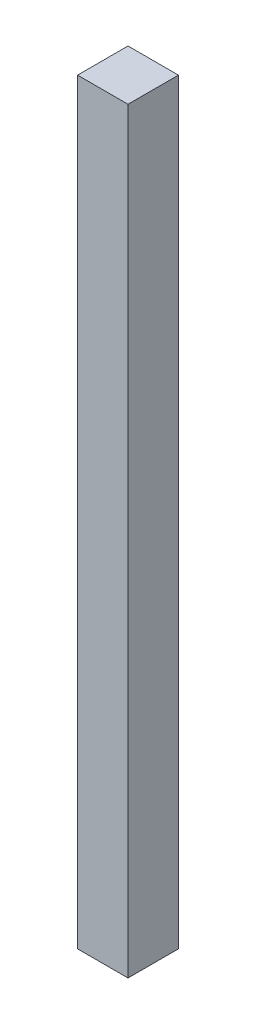
ISO-10303-21;
HEADER;
FILE_DESCRIPTION(('STEP AP214'),'2;1');
FILE_NAME('part.step','',(''),(''),'','','');
FILE_SCHEMA(('AUTOMOTIVE_DESIGN { 1 0 10303 214 1 1 1 1 }'));
ENDSEC;
DATA;
#1=APPLICATION_CONTEXT('core data for automotive mechanical design processes');
#2=APPLICATION_PROTOCOL_DEFINITION('international standard','automotive_design',2000,#1);
#3=PRODUCT_CONTEXT('',#1,'mechanical');
#4=PRODUCT('Part','Part','',(#3));
#5=PRODUCT_RELATED_PRODUCT_CATEGORY('part','',(#4));
#6=PRODUCT_DEFINITION_FORMATION('','',#4);
#7=PRODUCT_DEFINITION_CONTEXT('part definition',#1,'design');
#8=PRODUCT_DEFINITION('design','',#6,#7);
#9=PRODUCT_DEFINITION_SHAPE('','',#8);
#10=(LENGTH_UNIT() NAMED_UNIT(*) SI_UNIT(.MILLI.,.METRE.));
#11=(NAMED_UNIT(*) PLANE_ANGLE_UNIT() SI_UNIT($,.RADIAN.));
#12=(NAMED_UNIT(*) SI_UNIT($,.STERADIAN.) SOLID_ANGLE_UNIT());
#13=UNCERTAINTY_MEASURE_WITH_UNIT(LENGTH_MEASURE(1.E-05),#10,'distance_accuracy_value','');
#14=(GEOMETRIC_REPRESENTATION_CONTEXT(3) GLOBAL_UNCERTAINTY_ASSIGNED_CONTEXT((#13)) GLOBAL_UNIT_ASSIGNED_CONTEXT((#10,
#11,#12)) REPRESENTATION_CONTEXT('',''));
#15=CARTESIAN_POINT('',(0.,0.,0.));
#16=DIRECTION('',(0.,0.,1.));
#17=DIRECTION('',(1.,0.,0.));
#18=AXIS2_PLACEMENT_3D('',#15,#16,#17);
#19=CARTESIAN_POINT('',(1.11022302462516E-12,381.000000000001,-1.11022302462516E-13));
#20=DIRECTION('',(1.,0.,0.));
#21=DIRECTION('',(0.,0.,-1.));
#22=AXIS2_PLACEMENT_3D('',#19,#20,#21);
#23=PLANE('',#22);
#24=DIRECTION('',(0.,0.,1.));
#25=VECTOR('',#24,1.);
#26=CARTESIAN_POINT('',(0.,0.,0.));
#27=LINE('',#26,#25);
#28=CARTESIAN_POINT('',(-4.44089209850063E-13,1.55431223447522E-12,-25.400000000001));
#29=VERTEX_POINT('',#28);
#30=CARTESIAN_POINT('',(0.,0.,0.));
#31=VERTEX_POINT('',#30);
#32=EDGE_CURVE('E97',#29,#31,#27,.T.);
#33=ORIENTED_EDGE('',*,*,#32,.T.);
#34=DIRECTION('',(0.,-1.,0.));
#35=VECTOR('',#34,1.);
#36=CARTESIAN_POINT('',(1.11022302462516E-12,381.000000000001,-1.11022302462516E-13));
#37=LINE('',#36,#35);
#38=CARTESIAN_POINT('',(1.11022302462516E-12,381.000000000001,-1.11022302462516E-13));
#39=VERTEX_POINT('',#38);
#40=EDGE_CURVE('E11',#39,#31,#37,.T.);
#41=ORIENTED_EDGE('',*,*,#40,.F.);
#42=DIRECTION('',(0.,0.,1.));
#43=VECTOR('',#42,1.);
#44=CARTESIAN_POINT('',(1.11022302462516E-12,381.000000000001,-1.11022302462516E-13));
#45=LINE('',#44,#43);
#46=CARTESIAN_POINT('',(1.99840144432528E-12,381.000000000001,-25.4000000000013));
#47=VERTEX_POINT('',#46);
#48=EDGE_CURVE('E85',#47,#39,#45,.T.);
#49=ORIENTED_EDGE('',*,*,#48,.F.);
#50=DIRECTION('',(0.,-1.,0.));
#51=VECTOR('',#50,1.);
#52=CARTESIAN_POINT('',(1.99840144432528E-12,381.000000000001,-25.4000000000013));
#53=LINE('',#52,#51);
#54=EDGE_CURVE('E93',#47,#29,#53,.T.);
#55=ORIENTED_EDGE('',*,*,#54,.T.);
#56=EDGE_LOOP('',(#33,#41,#49,#55));
#57=FACE_BOUND('',#56,.T.);
#58=ADVANCED_FACE('F34',(#57),#23,.F.);
#59=CARTESIAN_POINT('',(1.11022302462516E-12,381.000000000001,-1.11022302462516E-13));
#60=DIRECTION('',(0.,0.,-1.));
#61=DIRECTION('',(-1.,0.,0.));
#62=AXIS2_PLACEMENT_3D('',#59,#60,#61);
#63=PLANE('',#62);
#64=DIRECTION('',(1.,0.,0.));
#65=VECTOR('',#64,1.);
#66=CARTESIAN_POINT('',(0.,0.,0.));
#67=LINE('',#66,#65);
#68=CARTESIAN_POINT('',(25.3999999999994,0.,0.));
#69=VERTEX_POINT('',#68);
#70=EDGE_CURVE('E89',#31,#69,#67,.T.);
#71=ORIENTED_EDGE('',*,*,#70,.T.);
#72=DIRECTION('',(0.,-1.,0.));
#73=VECTOR('',#72,1.);
#74=CARTESIAN_POINT('',(25.4000000000003,381.000000000001,-5.55111512312578E-13));
#75=LINE('',#74,#73);
#76=CARTESIAN_POINT('',(25.4000000000003,381.000000000001,-5.55111512312578E-13));
#77=VERTEX_POINT('',#76);
#78=EDGE_CURVE('E42',#77,#69,#75,.T.);
#79=ORIENTED_EDGE('',*,*,#78,.F.);
#80=DIRECTION('',(1.,0.,0.));
#81=VECTOR('',#80,1.);
#82=CARTESIAN_POINT('',(1.11022302462516E-12,381.000000000001,-1.11022302462516E-13));
#83=LINE('',#82,#81);
#84=EDGE_CURVE('E80',#39,#77,#83,.T.);
#85=ORIENTED_EDGE('',*,*,#84,.F.);
#86=ORIENTED_EDGE('',*,*,#40,.T.);
#87=EDGE_LOOP('',(#71,#79,#85,#86));
#88=FACE_BOUND('',#87,.T.);
#89=ADVANCED_FACE('F88',(#88),#63,.F.);
#90=CARTESIAN_POINT('',(25.4000000000003,381.000000000001,-5.55111512312578E-13));
#91=DIRECTION('',(-1.,0.,0.));
#92=DIRECTION('',(0.,0.,1.));
#93=AXIS2_PLACEMENT_3D('',#90,#91,#92);
#94=PLANE('',#93);
#95=DIRECTION('',(0.,0.,-1.));
#96=VECTOR('',#95,1.);
#97=CARTESIAN_POINT('',(25.3999999999994,0.,0.));
#98=LINE('',#97,#96);
#99=CARTESIAN_POINT('',(25.3999999999996,4.44089209850063E-13,-25.4000000000003));
#100=VERTEX_POINT('',#99);
#101=EDGE_CURVE('E67',#69,#100,#98,.T.);
#102=ORIENTED_EDGE('',*,*,#101,.T.);
#103=DIRECTION('',(0.,-1.,0.));
#104=VECTOR('',#103,1.);
#105=CARTESIAN_POINT('',(25.4000000000014,381.,-25.4000000000014));
#106=LINE('',#105,#104);
#107=CARTESIAN_POINT('',(25.4000000000014,381.,-25.4000000000014));
#108=VERTEX_POINT('',#107);
#109=EDGE_CURVE('E90',#108,#100,#106,.T.);
#110=ORIENTED_EDGE('',*,*,#109,.F.);
#111=DIRECTION('',(0.,0.,-1.));
#112=VECTOR('',#111,1.);
#113=CARTESIAN_POINT('',(25.4000000000003,381.000000000001,-5.55111512312578E-13));
#114=LINE('',#113,#112);
#115=EDGE_CURVE('E83',#77,#108,#114,.T.);
#116=ORIENTED_EDGE('',*,*,#115,.F.);
#117=ORIENTED_EDGE('',*,*,#78,.T.);
#118=EDGE_LOOP('',(#102,#110,#116,#117));
#119=FACE_BOUND('',#118,.T.);
#120=ADVANCED_FACE('F91',(#119),#94,.F.);
#121=CARTESIAN_POINT('',(1.99840144432528E-12,381.000000000001,-25.4000000000013));
#122=DIRECTION('',(0.,0.,1.));
#123=DIRECTION('',(1.,0.,0.));
#124=AXIS2_PLACEMENT_3D('',#121,#122,#123);
#125=PLANE('',#124);
#126=DIRECTION('',(-1.,0.,0.));
#127=VECTOR('',#126,1.);
#128=CARTESIAN_POINT('',(-4.44089209850063E-13,1.55431223447522E-12,-25.400000000001));
#129=LINE('',#128,#127);
#130=EDGE_CURVE('E73',#100,#29,#129,.T.);
#131=ORIENTED_EDGE('',*,*,#130,.T.);
#132=ORIENTED_EDGE('',*,*,#54,.F.);
#133=DIRECTION('',(-1.,0.,0.));
#134=VECTOR('',#133,1.);
#135=CARTESIAN_POINT('',(1.99840144432528E-12,381.000000000001,-25.4000000000013));
#136=LINE('',#135,#134);
#137=EDGE_CURVE('E50',#108,#47,#136,.T.);
#138=ORIENTED_EDGE('',*,*,#137,.F.);
#139=ORIENTED_EDGE('',*,*,#109,.T.);
#140=EDGE_LOOP('',(#131,#132,#138,#139));
#141=FACE_BOUND('',#140,.T.);
#142=ADVANCED_FACE('F104',(#141),#125,.F.);
#143=CARTESIAN_POINT('',(1.11022302462516E-12,381.000000000001,-1.11022302462516E-13));
#144=DIRECTION('',(0.,-1.,0.));
#145=DIRECTION('',(0.,0.,-1.));
#146=AXIS2_PLACEMENT_3D('',#143,#144,#145);
#147=PLANE('',#146);
#148=ORIENTED_EDGE('',*,*,#48,.T.);
#149=ORIENTED_EDGE('',*,*,#84,.T.);
#150=ORIENTED_EDGE('',*,*,#115,.T.);
#151=ORIENTED_EDGE('',*,*,#137,.T.);
#152=EDGE_LOOP('',(#148,#149,#150,#151));
#153=FACE_BOUND('',#152,.T.);
#154=ADVANCED_FACE('F81',(#153),#147,.F.);
#155=CARTESIAN_POINT('',(0.,0.,0.));
#156=DIRECTION('',(0.,-1.,0.));
#157=DIRECTION('',(0.,0.,-1.));
#158=AXIS2_PLACEMENT_3D('',#155,#156,#157);
#159=PLANE('',#158);
#160=ORIENTED_EDGE('',*,*,#32,.F.);
#161=ORIENTED_EDGE('',*,*,#130,.F.);
#162=ORIENTED_EDGE('',*,*,#101,.F.);
#163=ORIENTED_EDGE('',*,*,#70,.F.);
#164=EDGE_LOOP('',(#160,#161,#162,#163));
#165=FACE_BOUND('',#164,.T.);
#166=ADVANCED_FACE('F107',(#165),#159,.T.);
#167=CLOSED_SHELL('',(#58,#89,#120,#142,#154,#166));
#168=MANIFOLD_SOLID_BREP('B2',#167);
#169=ADVANCED_BREP_SHAPE_REPRESENTATION('',(#18,#168),#14);
#170=SHAPE_DEFINITION_REPRESENTATION(#9,#169);
ENDSEC;
END-ISO-10303-21;
